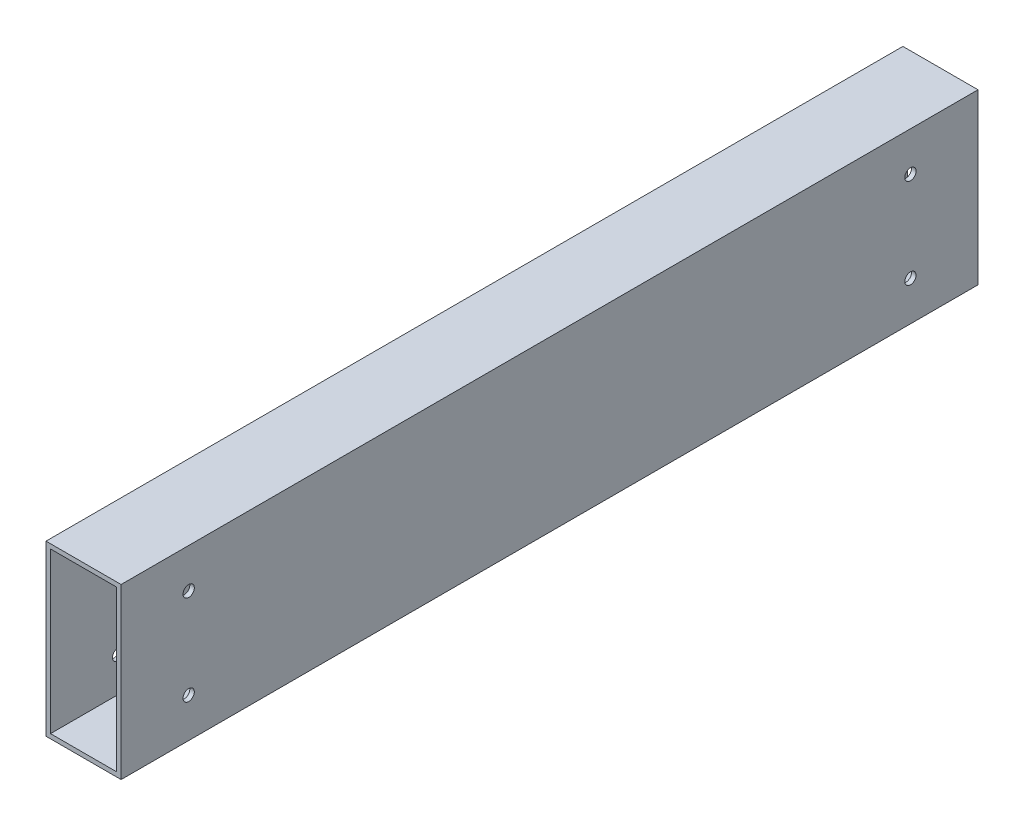
ISO-10303-21;
HEADER;
FILE_DESCRIPTION(('STEP AP214'),'2;1');
FILE_NAME('part.step','',(''),(''),'','','');
FILE_SCHEMA(('AUTOMOTIVE_DESIGN { 1 0 10303 214 1 1 1 1 }'));
ENDSEC;
DATA;
#1=APPLICATION_CONTEXT('core data for automotive mechanical design processes');
#2=APPLICATION_PROTOCOL_DEFINITION('international standard','automotive_design',2000,#1);
#3=PRODUCT_CONTEXT('',#1,'mechanical');
#4=PRODUCT('Part','Part','',(#3));
#5=PRODUCT_RELATED_PRODUCT_CATEGORY('part','',(#4));
#6=PRODUCT_DEFINITION_FORMATION('','',#4);
#7=PRODUCT_DEFINITION_CONTEXT('part definition',#1,'design');
#8=PRODUCT_DEFINITION('design','',#6,#7);
#9=PRODUCT_DEFINITION_SHAPE('','',#8);
#10=(LENGTH_UNIT() NAMED_UNIT(*) SI_UNIT(.MILLI.,.METRE.));
#11=(NAMED_UNIT(*) PLANE_ANGLE_UNIT() SI_UNIT($,.RADIAN.));
#12=(NAMED_UNIT(*) SI_UNIT($,.STERADIAN.) SOLID_ANGLE_UNIT());
#13=UNCERTAINTY_MEASURE_WITH_UNIT(LENGTH_MEASURE(1.E-05),#10,'distance_accuracy_value','');
#14=(GEOMETRIC_REPRESENTATION_CONTEXT(3) GLOBAL_UNCERTAINTY_ASSIGNED_CONTEXT((#13)) GLOBAL_UNIT_ASSIGNED_CONTEXT((#10,
#11,#12)) REPRESENTATION_CONTEXT('',''));
#15=CARTESIAN_POINT('',(0.,0.,0.));
#16=DIRECTION('',(0.,0.,1.));
#17=DIRECTION('',(1.,0.,0.));
#18=AXIS2_PLACEMENT_3D('',#15,#16,#17);
#19=CARTESIAN_POINT('',(10.0000000000001,-22.5,228.2));
#20=DIRECTION('',(-0.999999999999999,0.,0.));
#21=DIRECTION('',(0.,0.,0.999999999999999));
#22=AXIS2_PLACEMENT_3D('',#19,#20,#21);
#23=PLANE('',#22);
#24=CARTESIAN_POINT('',(10.0000000000001,-11.9999999999999,18.));
#25=DIRECTION('',(0.999999999999999,0.,0.));
#26=DIRECTION('',(0.,0.,-0.999999999999999));
#27=AXIS2_PLACEMENT_3D('',#24,#25,#26);
#28=CIRCLE('',#27,1.5);
#29=CARTESIAN_POINT('',(10.0000000000001,-11.9999999999999,16.5));
#30=VERTEX_POINT('',#29);
#31=EDGE_CURVE('E242',#30,#30,#28,.T.);
#32=ORIENTED_EDGE('',*,*,#31,.F.);
#33=EDGE_LOOP('',(#32));
#34=FACE_BOUND('',#33,.T.);
#35=CARTESIAN_POINT('',(10.0000000000001,12.0000000000001,17.9999999999999));
#36=DIRECTION('',(0.999999999999999,0.,0.));
#37=DIRECTION('',(0.,0.,-0.999999999999999));
#38=AXIS2_PLACEMENT_3D('',#35,#36,#37);
#39=CIRCLE('',#38,1.5);
#40=CARTESIAN_POINT('',(10.0000000000001,12.0000000000001,16.4999999999999));
#41=VERTEX_POINT('',#40);
#42=EDGE_CURVE('E246',#41,#41,#39,.T.);
#43=ORIENTED_EDGE('',*,*,#42,.F.);
#44=EDGE_LOOP('',(#43));
#45=FACE_BOUND('',#44,.T.);
#46=CARTESIAN_POINT('',(9.99999999999995,12.,210.2));
#47=DIRECTION('',(0.999999999999999,0.,0.));
#48=DIRECTION('',(0.,0.,-0.999999999999999));
#49=AXIS2_PLACEMENT_3D('',#46,#47,#48);
#50=CIRCLE('',#49,1.5);
#51=CARTESIAN_POINT('',(9.99999999999995,12.,208.7));
#52=VERTEX_POINT('',#51);
#53=EDGE_CURVE('E250',#52,#52,#50,.T.);
#54=ORIENTED_EDGE('',*,*,#53,.F.);
#55=EDGE_LOOP('',(#54));
#56=FACE_BOUND('',#55,.T.);
#57=CARTESIAN_POINT('',(10.0000000000001,-12.,210.2));
#58=DIRECTION('',(0.999999999999999,0.,0.));
#59=DIRECTION('',(0.,0.,-0.999999999999999));
#60=AXIS2_PLACEMENT_3D('',#57,#58,#59);
#61=CIRCLE('',#60,1.5);
#62=CARTESIAN_POINT('',(10.0000000000001,-12.,208.7));
#63=VERTEX_POINT('',#62);
#64=EDGE_CURVE('E165',#63,#63,#61,.T.);
#65=ORIENTED_EDGE('',*,*,#64,.F.);
#66=EDGE_LOOP('',(#65));
#67=FACE_BOUND('',#66,.T.);
#68=DIRECTION('',(0.,1.,0.));
#69=VECTOR('',#68,1.);
#70=CARTESIAN_POINT('',(10.0000000000002,-22.5,-1.11022302462516E-13));
#71=LINE('',#70,#69);
#72=CARTESIAN_POINT('',(10.0000000000002,-22.5,-1.11022302462516E-13));
#73=VERTEX_POINT('',#72);
#74=CARTESIAN_POINT('',(10.0000000000002,22.5,1.11022302462516E-13));
#75=VERTEX_POINT('',#74);
#76=EDGE_CURVE('E134',#73,#75,#71,.T.);
#77=ORIENTED_EDGE('',*,*,#76,.T.);
#78=DIRECTION('',(0.,0.,-0.999999999999999));
#79=VECTOR('',#78,1.);
#80=CARTESIAN_POINT('',(9.99999999999995,22.5,228.2));
#81=LINE('',#80,#79);
#82=CARTESIAN_POINT('',(9.99999999999995,22.5,228.2));
#83=VERTEX_POINT('',#82);
#84=EDGE_CURVE('E11',#83,#75,#81,.T.);
#85=ORIENTED_EDGE('',*,*,#84,.F.);
#86=DIRECTION('',(0.,1.,0.));
#87=VECTOR('',#86,1.);
#88=CARTESIAN_POINT('',(10.0000000000001,-22.5,228.2));
#89=LINE('',#88,#87);
#90=CARTESIAN_POINT('',(10.0000000000001,-22.5,228.2));
#91=VERTEX_POINT('',#90);
#92=EDGE_CURVE('E136',#91,#83,#89,.T.);
#93=ORIENTED_EDGE('',*,*,#92,.F.);
#94=DIRECTION('',(0.,0.,-0.999999999999999));
#95=VECTOR('',#94,1.);
#96=CARTESIAN_POINT('',(10.0000000000001,-22.5,228.2));
#97=LINE('',#96,#95);
#98=EDGE_CURVE('E146',#91,#73,#97,.T.);
#99=ORIENTED_EDGE('',*,*,#98,.T.);
#100=EDGE_LOOP('',(#77,#85,#93,#99));
#101=FACE_BOUND('',#100,.T.);
#102=ADVANCED_FACE('F38',(#34,#45,#56,#67,#101),#23,.F.);
#103=CARTESIAN_POINT('',(-10.0000000000001,22.5,228.2));
#104=DIRECTION('',(0.,-1.,0.));
#105=DIRECTION('',(0.,0.,-0.999999999999999));
#106=AXIS2_PLACEMENT_3D('',#103,#104,#105);
#107=PLANE('',#106);
#108=DIRECTION('',(-0.999999999999999,0.,0.));
#109=VECTOR('',#108,1.);
#110=CARTESIAN_POINT('',(-9.99999999999984,22.5,0.));
#111=LINE('',#110,#109);
#112=CARTESIAN_POINT('',(-9.99999999999984,22.5,0.));
#113=VERTEX_POINT('',#112);
#114=EDGE_CURVE('E149',#75,#113,#111,.T.);
#115=ORIENTED_EDGE('',*,*,#114,.T.);
#116=DIRECTION('',(0.,0.,-0.999999999999999));
#117=VECTOR('',#116,1.);
#118=CARTESIAN_POINT('',(-10.0000000000001,22.5,228.2));
#119=LINE('',#118,#117);
#120=CARTESIAN_POINT('',(-10.0000000000001,22.5,228.2));
#121=VERTEX_POINT('',#120);
#122=EDGE_CURVE('E46',#121,#113,#119,.T.);
#123=ORIENTED_EDGE('',*,*,#122,.F.);
#124=DIRECTION('',(-0.999999999999999,0.,0.));
#125=VECTOR('',#124,1.);
#126=CARTESIAN_POINT('',(-10.0000000000001,22.5,228.2));
#127=LINE('',#126,#125);
#128=EDGE_CURVE('E139',#83,#121,#127,.T.);
#129=ORIENTED_EDGE('',*,*,#128,.F.);
#130=ORIENTED_EDGE('',*,*,#84,.T.);
#131=EDGE_LOOP('',(#115,#123,#129,#130));
#132=FACE_BOUND('',#131,.T.);
#133=ADVANCED_FACE('F218',(#132),#107,.F.);
#134=CARTESIAN_POINT('',(-10.,-22.5,228.2));
#135=DIRECTION('',(0.999999999999999,0.,0.));
#136=DIRECTION('',(0.,0.,-0.999999999999999));
#137=AXIS2_PLACEMENT_3D('',#134,#135,#136);
#138=PLANE('',#137);
#139=CARTESIAN_POINT('',(-9.9999999999999,-11.9999999999999,17.9999999999999));
#140=DIRECTION('',(0.999999999999999,0.,0.));
#141=DIRECTION('',(0.,0.,-0.999999999999999));
#142=AXIS2_PLACEMENT_3D('',#139,#140,#141);
#143=CIRCLE('',#142,1.5);
#144=CARTESIAN_POINT('',(-9.9999999999999,-11.9999999999999,16.4999999999999));
#145=VERTEX_POINT('',#144);
#146=EDGE_CURVE('E192',#145,#145,#143,.T.);
#147=ORIENTED_EDGE('',*,*,#146,.T.);
#148=EDGE_LOOP('',(#147));
#149=FACE_BOUND('',#148,.T.);
#150=CARTESIAN_POINT('',(-9.99999999999995,12.,17.9999999999999));
#151=DIRECTION('',(0.999999999999999,0.,0.));
#152=DIRECTION('',(0.,0.,-0.999999999999999));
#153=AXIS2_PLACEMENT_3D('',#150,#151,#152);
#154=CIRCLE('',#153,1.5);
#155=CARTESIAN_POINT('',(-9.99999999999995,12.,16.4999999999999));
#156=VERTEX_POINT('',#155);
#157=EDGE_CURVE('E177',#156,#156,#154,.T.);
#158=ORIENTED_EDGE('',*,*,#157,.T.);
#159=EDGE_LOOP('',(#158));
#160=FACE_BOUND('',#159,.T.);
#161=CARTESIAN_POINT('',(-10.,12.,210.2));
#162=DIRECTION('',(0.999999999999999,0.,0.));
#163=DIRECTION('',(0.,0.,-0.999999999999999));
#164=AXIS2_PLACEMENT_3D('',#161,#162,#163);
#165=CIRCLE('',#164,1.5);
#166=CARTESIAN_POINT('',(-10.,12.,208.7));
#167=VERTEX_POINT('',#166);
#168=EDGE_CURVE('E173',#167,#167,#165,.T.);
#169=ORIENTED_EDGE('',*,*,#168,.T.);
#170=EDGE_LOOP('',(#169));
#171=FACE_BOUND('',#170,.T.);
#172=CARTESIAN_POINT('',(-10.,-12.,210.2));
#173=DIRECTION('',(0.999999999999999,0.,0.));
#174=DIRECTION('',(0.,0.,-0.999999999999999));
#175=AXIS2_PLACEMENT_3D('',#172,#173,#174);
#176=CIRCLE('',#175,1.5);
#177=CARTESIAN_POINT('',(-10.,-12.,208.7));
#178=VERTEX_POINT('',#177);
#179=EDGE_CURVE('E169',#178,#178,#176,.T.);
#180=ORIENTED_EDGE('',*,*,#179,.T.);
#181=EDGE_LOOP('',(#180));
#182=FACE_BOUND('',#181,.T.);
#183=DIRECTION('',(0.,-1.,0.));
#184=VECTOR('',#183,1.);
#185=CARTESIAN_POINT('',(-9.99999999999962,-22.5,1.11022302462516E-13));
#186=LINE('',#185,#184);
#187=CARTESIAN_POINT('',(-9.99999999999962,-22.5,1.11022302462516E-13));
#188=VERTEX_POINT('',#187);
#189=EDGE_CURVE('E151',#113,#188,#186,.T.);
#190=ORIENTED_EDGE('',*,*,#189,.T.);
#191=DIRECTION('',(0.,0.,-0.999999999999999));
#192=VECTOR('',#191,1.);
#193=CARTESIAN_POINT('',(-10.,-22.5,228.2));
#194=LINE('',#193,#192);
#195=CARTESIAN_POINT('',(-10.,-22.5,228.2));
#196=VERTEX_POINT('',#195);
#197=EDGE_CURVE('E156',#196,#188,#194,.T.);
#198=ORIENTED_EDGE('',*,*,#197,.F.);
#199=DIRECTION('',(0.,-1.,0.));
#200=VECTOR('',#199,1.);
#201=CARTESIAN_POINT('',(-10.,-22.5,228.2));
#202=LINE('',#201,#200);
#203=EDGE_CURVE('E142',#121,#196,#202,.T.);
#204=ORIENTED_EDGE('',*,*,#203,.F.);
#205=ORIENTED_EDGE('',*,*,#122,.T.);
#206=EDGE_LOOP('',(#190,#198,#204,#205));
#207=FACE_BOUND('',#206,.T.);
#208=ADVANCED_FACE('F223',(#149,#160,#171,#182,#207),#138,.F.);
#209=CARTESIAN_POINT('',(-10.,-22.5,228.2));
#210=DIRECTION('',(0.,1.,0.));
#211=DIRECTION('',(0.,0.,0.999999999999999));
#212=AXIS2_PLACEMENT_3D('',#209,#210,#211);
#213=PLANE('',#212);
#214=DIRECTION('',(0.999999999999999,0.,0.));
#215=VECTOR('',#214,1.);
#216=CARTESIAN_POINT('',(-9.99999999999962,-22.5,1.11022302462516E-13));
#217=LINE('',#216,#215);
#218=EDGE_CURVE('E140',#188,#73,#217,.T.);
#219=ORIENTED_EDGE('',*,*,#218,.T.);
#220=ORIENTED_EDGE('',*,*,#98,.F.);
#221=DIRECTION('',(0.999999999999999,0.,0.));
#222=VECTOR('',#221,1.);
#223=CARTESIAN_POINT('',(-10.,-22.5,228.2));
#224=LINE('',#223,#222);
#225=EDGE_CURVE('E144',#196,#91,#224,.T.);
#226=ORIENTED_EDGE('',*,*,#225,.F.);
#227=ORIENTED_EDGE('',*,*,#197,.T.);
#228=EDGE_LOOP('',(#219,#220,#226,#227));
#229=FACE_BOUND('',#228,.T.);
#230=ADVANCED_FACE('F208',(#229),#213,.F.);
#231=CARTESIAN_POINT('',(-1.11022302462516E-13,0.,228.2));
#232=DIRECTION('',(0.,0.,-0.999999999999999));
#233=DIRECTION('',(-0.999999999999999,0.,0.));
#234=AXIS2_PLACEMENT_3D('',#231,#232,#233);
#235=PLANE('',#234);
#236=DIRECTION('',(0.999999999999999,0.,0.));
#237=VECTOR('',#236,1.);
#238=CARTESIAN_POINT('',(8.79999999999992,-21.3000000000001,228.2));
#239=LINE('',#238,#237);
#240=CARTESIAN_POINT('',(-8.80000000000014,-21.3,228.2));
#241=VERTEX_POINT('',#240);
#242=CARTESIAN_POINT('',(8.79999999999992,-21.3000000000001,228.2));
#243=VERTEX_POINT('',#242);
#244=EDGE_CURVE('E196',#241,#243,#239,.T.);
#245=ORIENTED_EDGE('',*,*,#244,.F.);
#246=DIRECTION('',(0.,-1.,0.));
#247=VECTOR('',#246,1.);
#248=CARTESIAN_POINT('',(-8.80000000000009,21.3,228.2));
#249=LINE('',#248,#247);
#250=CARTESIAN_POINT('',(-8.80000000000009,21.3,228.2));
#251=VERTEX_POINT('',#250);
#252=EDGE_CURVE('E135',#251,#241,#249,.T.);
#253=ORIENTED_EDGE('',*,*,#252,.F.);
#254=DIRECTION('',(-0.999999999999999,0.,0.));
#255=VECTOR('',#254,1.);
#256=CARTESIAN_POINT('',(8.79999999999992,21.3,228.2));
#257=LINE('',#256,#255);
#258=CARTESIAN_POINT('',(8.79999999999992,21.3,228.2));
#259=VERTEX_POINT('',#258);
#260=EDGE_CURVE('E132',#259,#251,#257,.T.);
#261=ORIENTED_EDGE('',*,*,#260,.F.);
#262=DIRECTION('',(0.,1.,0.));
#263=VECTOR('',#262,1.);
#264=CARTESIAN_POINT('',(8.79999999999992,21.3,228.2));
#265=LINE('',#264,#263);
#266=EDGE_CURVE('E110',#243,#259,#265,.T.);
#267=ORIENTED_EDGE('',*,*,#266,.F.);
#268=EDGE_LOOP('',(#245,#253,#261,#267));
#269=FACE_BOUND('',#268,.T.);
#270=ORIENTED_EDGE('',*,*,#92,.T.);
#271=ORIENTED_EDGE('',*,*,#128,.T.);
#272=ORIENTED_EDGE('',*,*,#203,.T.);
#273=ORIENTED_EDGE('',*,*,#225,.T.);
#274=EDGE_LOOP('',(#270,#271,#272,#273));
#275=FACE_BOUND('',#274,.T.);
#276=ADVANCED_FACE('F205',(#269,#275),#235,.F.);
#277=CARTESIAN_POINT('',(0.,0.,0.));
#278=DIRECTION('',(0.,0.,-0.999999999999999));
#279=DIRECTION('',(-0.999999999999999,0.,0.));
#280=AXIS2_PLACEMENT_3D('',#277,#278,#279);
#281=PLANE('',#280);
#282=DIRECTION('',(0.,1.,0.));
#283=VECTOR('',#282,1.);
#284=CARTESIAN_POINT('',(-8.79999999999981,21.3,0.));
#285=LINE('',#284,#283);
#286=CARTESIAN_POINT('',(-8.79999999999992,-21.3,0.));
#287=VERTEX_POINT('',#286);
#288=CARTESIAN_POINT('',(-8.79999999999981,21.3,0.));
#289=VERTEX_POINT('',#288);
#290=EDGE_CURVE('E62',#287,#289,#285,.T.);
#291=ORIENTED_EDGE('',*,*,#290,.F.);
#292=DIRECTION('',(-0.999999999999999,0.,0.));
#293=VECTOR('',#292,1.);
#294=CARTESIAN_POINT('',(8.80000000000009,-21.3,0.));
#295=LINE('',#294,#293);
#296=CARTESIAN_POINT('',(8.80000000000009,-21.3,0.));
#297=VERTEX_POINT('',#296);
#298=EDGE_CURVE('E123',#297,#287,#295,.T.);
#299=ORIENTED_EDGE('',*,*,#298,.F.);
#300=DIRECTION('',(0.,-1.,0.));
#301=VECTOR('',#300,1.);
#302=CARTESIAN_POINT('',(8.8000000000002,21.3,-1.11022302462516E-13));
#303=LINE('',#302,#301);
#304=CARTESIAN_POINT('',(8.8000000000002,21.3,-1.11022302462516E-13));
#305=VERTEX_POINT('',#304);
#306=EDGE_CURVE('E107',#305,#297,#303,.T.);
#307=ORIENTED_EDGE('',*,*,#306,.F.);
#308=DIRECTION('',(0.999999999999999,0.,0.));
#309=VECTOR('',#308,1.);
#310=CARTESIAN_POINT('',(8.8000000000002,21.3,-1.11022302462516E-13));
#311=LINE('',#310,#309);
#312=EDGE_CURVE('E116',#289,#305,#311,.T.);
#313=ORIENTED_EDGE('',*,*,#312,.F.);
#314=EDGE_LOOP('',(#291,#299,#307,#313));
#315=FACE_BOUND('',#314,.T.);
#316=ORIENTED_EDGE('',*,*,#76,.F.);
#317=ORIENTED_EDGE('',*,*,#218,.F.);
#318=ORIENTED_EDGE('',*,*,#189,.F.);
#319=ORIENTED_EDGE('',*,*,#114,.F.);
#320=EDGE_LOOP('',(#316,#317,#318,#319));
#321=FACE_BOUND('',#320,.T.);
#322=ADVANCED_FACE('F120',(#315,#321),#281,.T.);
#323=CARTESIAN_POINT('',(-8.79999999999981,21.3,274.292515661439));
#324=DIRECTION('',(-0.999999999999999,0.,0.));
#325=DIRECTION('',(0.,0.,0.999999999999999));
#326=AXIS2_PLACEMENT_3D('',#323,#324,#325);
#327=PLANE('',#326);
#328=CARTESIAN_POINT('',(-8.79999999999997,-11.9999999999999,18.));
#329=DIRECTION('',(-0.999999999999999,0.,0.));
#330=DIRECTION('',(0.,0.,0.999999999999999));
#331=AXIS2_PLACEMENT_3D('',#328,#329,#330);
#332=CIRCLE('',#331,1.5);
#333=CARTESIAN_POINT('',(-8.79999999999997,-11.9999999999999,19.5));
#334=VERTEX_POINT('',#333);
#335=EDGE_CURVE('E189',#334,#334,#332,.T.);
#336=ORIENTED_EDGE('',*,*,#335,.T.);
#337=EDGE_LOOP('',(#336));
#338=FACE_BOUND('',#337,.T.);
#339=CARTESIAN_POINT('',(-8.79999999999992,12.0000000000001,18.));
#340=DIRECTION('',(-0.999999999999999,0.,0.));
#341=DIRECTION('',(0.,0.,0.999999999999999));
#342=AXIS2_PLACEMENT_3D('',#339,#340,#341);
#343=CIRCLE('',#342,1.5);
#344=CARTESIAN_POINT('',(-8.79999999999992,12.0000000000001,19.5));
#345=VERTEX_POINT('',#344);
#346=EDGE_CURVE('E172',#345,#345,#343,.T.);
#347=ORIENTED_EDGE('',*,*,#346,.T.);
#348=EDGE_LOOP('',(#347));
#349=FACE_BOUND('',#348,.T.);
#350=CARTESIAN_POINT('',(-8.80000000000009,12.,210.2));
#351=DIRECTION('',(-0.999999999999999,0.,0.));
#352=DIRECTION('',(0.,0.,0.999999999999999));
#353=AXIS2_PLACEMENT_3D('',#350,#351,#352);
#354=CIRCLE('',#353,1.5);
#355=CARTESIAN_POINT('',(-8.80000000000009,12.,211.7));
#356=VERTEX_POINT('',#355);
#357=EDGE_CURVE('E168',#356,#356,#354,.T.);
#358=ORIENTED_EDGE('',*,*,#357,.T.);
#359=EDGE_LOOP('',(#358));
#360=FACE_BOUND('',#359,.T.);
#361=CARTESIAN_POINT('',(-8.79999999999992,-11.9999999999999,210.2));
#362=DIRECTION('',(-0.999999999999999,0.,0.));
#363=DIRECTION('',(0.,0.,0.999999999999999));
#364=AXIS2_PLACEMENT_3D('',#361,#362,#363);
#365=CIRCLE('',#364,1.5);
#366=CARTESIAN_POINT('',(-8.79999999999992,-11.9999999999999,211.7));
#367=VERTEX_POINT('',#366);
#368=EDGE_CURVE('E164',#367,#367,#365,.T.);
#369=ORIENTED_EDGE('',*,*,#368,.T.);
#370=EDGE_LOOP('',(#369));
#371=FACE_BOUND('',#370,.T.);
#372=ORIENTED_EDGE('',*,*,#252,.T.);
#373=DIRECTION('',(0.,0.,-0.999999999999999));
#374=VECTOR('',#373,1.);
#375=CARTESIAN_POINT('',(-8.79999999999992,-21.3,274.292515661439));
#376=LINE('',#375,#374);
#377=EDGE_CURVE('E128',#241,#287,#376,.T.);
#378=ORIENTED_EDGE('',*,*,#377,.T.);
#379=ORIENTED_EDGE('',*,*,#290,.T.);
#380=DIRECTION('',(0.,0.,-0.999999999999999));
#381=VECTOR('',#380,1.);
#382=CARTESIAN_POINT('',(-8.79999999999981,21.3,274.292515661439));
#383=LINE('',#382,#381);
#384=EDGE_CURVE('E113',#251,#289,#383,.T.);
#385=ORIENTED_EDGE('',*,*,#384,.F.);
#386=EDGE_LOOP('',(#372,#378,#379,#385));
#387=FACE_BOUND('',#386,.T.);
#388=ADVANCED_FACE('F200',(#338,#349,#360,#371,#387),#327,.F.);
#389=CARTESIAN_POINT('',(8.80000000000014,-21.3000000000001,274.292515661439));
#390=DIRECTION('',(0.,-1.,0.));
#391=DIRECTION('',(0.,0.,-0.999999999999999));
#392=AXIS2_PLACEMENT_3D('',#389,#390,#391);
#393=PLANE('',#392);
#394=ORIENTED_EDGE('',*,*,#244,.T.);
#395=DIRECTION('',(0.,0.,-0.999999999999999));
#396=VECTOR('',#395,1.);
#397=CARTESIAN_POINT('',(8.80000000000014,-21.3000000000001,274.292515661439));
#398=LINE('',#397,#396);
#399=EDGE_CURVE('E112',#243,#297,#398,.T.);
#400=ORIENTED_EDGE('',*,*,#399,.T.);
#401=ORIENTED_EDGE('',*,*,#298,.T.);
#402=ORIENTED_EDGE('',*,*,#377,.F.);
#403=EDGE_LOOP('',(#394,#400,#401,#402));
#404=FACE_BOUND('',#403,.T.);
#405=ADVANCED_FACE('F204',(#404),#393,.F.);
#406=CARTESIAN_POINT('',(8.80000000000009,21.3,274.292515661439));
#407=DIRECTION('',(0.999999999999999,0.,0.));
#408=DIRECTION('',(0.,0.,-0.999999999999999));
#409=AXIS2_PLACEMENT_3D('',#406,#407,#408);
#410=PLANE('',#409);
#411=CARTESIAN_POINT('',(8.79999999999997,-12.,18.));
#412=DIRECTION('',(0.999999999999999,0.,0.));
#413=DIRECTION('',(0.,0.,-0.999999999999999));
#414=AXIS2_PLACEMENT_3D('',#411,#412,#413);
#415=CIRCLE('',#414,1.5);
#416=CARTESIAN_POINT('',(8.79999999999997,-12.,16.5));
#417=VERTEX_POINT('',#416);
#418=EDGE_CURVE('E41',#417,#417,#415,.T.);
#419=ORIENTED_EDGE('',*,*,#418,.T.);
#420=EDGE_LOOP('',(#419));
#421=FACE_BOUND('',#420,.T.);
#422=CARTESIAN_POINT('',(8.79999999999997,12.,18.));
#423=DIRECTION('',(0.999999999999999,0.,0.));
#424=DIRECTION('',(0.,0.,-0.999999999999999));
#425=AXIS2_PLACEMENT_3D('',#422,#423,#424);
#426=CIRCLE('',#425,1.5);
#427=CARTESIAN_POINT('',(8.79999999999997,12.,16.5));
#428=VERTEX_POINT('',#427);
#429=EDGE_CURVE('E170',#428,#428,#426,.T.);
#430=ORIENTED_EDGE('',*,*,#429,.T.);
#431=EDGE_LOOP('',(#430));
#432=FACE_BOUND('',#431,.T.);
#433=CARTESIAN_POINT('',(8.80000000000003,12.,210.2));
#434=DIRECTION('',(0.999999999999999,0.,0.));
#435=DIRECTION('',(0.,0.,-0.999999999999999));
#436=AXIS2_PLACEMENT_3D('',#433,#434,#435);
#437=CIRCLE('',#436,1.5);
#438=CARTESIAN_POINT('',(8.80000000000003,12.,208.7));
#439=VERTEX_POINT('',#438);
#440=EDGE_CURVE('E166',#439,#439,#437,.T.);
#441=ORIENTED_EDGE('',*,*,#440,.T.);
#442=EDGE_LOOP('',(#441));
#443=FACE_BOUND('',#442,.T.);
#444=CARTESIAN_POINT('',(8.80000000000009,-11.9999999999999,210.2));
#445=DIRECTION('',(0.999999999999999,0.,0.));
#446=DIRECTION('',(0.,0.,-0.999999999999999));
#447=AXIS2_PLACEMENT_3D('',#444,#445,#446);
#448=CIRCLE('',#447,1.5);
#449=CARTESIAN_POINT('',(8.80000000000009,-11.9999999999999,208.7));
#450=VERTEX_POINT('',#449);
#451=EDGE_CURVE('E161',#450,#450,#448,.T.);
#452=ORIENTED_EDGE('',*,*,#451,.T.);
#453=EDGE_LOOP('',(#452));
#454=FACE_BOUND('',#453,.T.);
#455=ORIENTED_EDGE('',*,*,#266,.T.);
#456=DIRECTION('',(0.,0.,-0.999999999999999));
#457=VECTOR('',#456,1.);
#458=CARTESIAN_POINT('',(8.80000000000009,21.3,274.292515661439));
#459=LINE('',#458,#457);
#460=EDGE_CURVE('E54',#259,#305,#459,.T.);
#461=ORIENTED_EDGE('',*,*,#460,.T.);
#462=ORIENTED_EDGE('',*,*,#306,.T.);
#463=ORIENTED_EDGE('',*,*,#399,.F.);
#464=EDGE_LOOP('',(#455,#461,#462,#463));
#465=FACE_BOUND('',#464,.T.);
#466=ADVANCED_FACE('F104',(#421,#432,#443,#454,#465),#410,.F.);
#467=CARTESIAN_POINT('',(8.80000000000009,21.3,274.292515661439));
#468=DIRECTION('',(0.,1.,0.));
#469=DIRECTION('',(0.,0.,0.999999999999999));
#470=AXIS2_PLACEMENT_3D('',#467,#468,#469);
#471=PLANE('',#470);
#472=ORIENTED_EDGE('',*,*,#260,.T.);
#473=ORIENTED_EDGE('',*,*,#384,.T.);
#474=ORIENTED_EDGE('',*,*,#312,.T.);
#475=ORIENTED_EDGE('',*,*,#460,.F.);
#476=EDGE_LOOP('',(#472,#473,#474,#475));
#477=FACE_BOUND('',#476,.T.);
#478=ADVANCED_FACE('F117',(#477),#471,.F.);
#479=CARTESIAN_POINT('',(-20.,-11.9999999999999,210.2));
#480=DIRECTION('',(0.999999999999999,0.,0.));
#481=DIRECTION('',(0.,0.,-0.999999999999999));
#482=AXIS2_PLACEMENT_3D('',#479,#480,#481);
#483=CYLINDRICAL_SURFACE('',#482,1.5);
#484=ORIENTED_EDGE('',*,*,#64,.T.);
#485=EDGE_LOOP('',(#484));
#486=FACE_BOUND('',#485,.T.);
#487=ORIENTED_EDGE('',*,*,#451,.F.);
#488=EDGE_LOOP('',(#487));
#489=FACE_BOUND('',#488,.T.);
#490=ADVANCED_FACE('F270',(#486,#489),#483,.F.);
#491=CARTESIAN_POINT('',(-20.,12.,210.2));
#492=DIRECTION('',(0.999999999999999,0.,0.));
#493=DIRECTION('',(0.,0.,-0.999999999999999));
#494=AXIS2_PLACEMENT_3D('',#491,#492,#493);
#495=CYLINDRICAL_SURFACE('',#494,1.5);
#496=ORIENTED_EDGE('',*,*,#53,.T.);
#497=EDGE_LOOP('',(#496));
#498=FACE_BOUND('',#497,.T.);
#499=ORIENTED_EDGE('',*,*,#440,.F.);
#500=EDGE_LOOP('',(#499));
#501=FACE_BOUND('',#500,.T.);
#502=ADVANCED_FACE('F278',(#498,#501),#495,.F.);
#503=CARTESIAN_POINT('',(-20.,12.,17.9999999999999));
#504=DIRECTION('',(0.999999999999999,0.,0.));
#505=DIRECTION('',(0.,0.,-0.999999999999999));
#506=AXIS2_PLACEMENT_3D('',#503,#504,#505);
#507=CYLINDRICAL_SURFACE('',#506,1.5);
#508=ORIENTED_EDGE('',*,*,#42,.T.);
#509=EDGE_LOOP('',(#508));
#510=FACE_BOUND('',#509,.T.);
#511=ORIENTED_EDGE('',*,*,#429,.F.);
#512=EDGE_LOOP('',(#511));
#513=FACE_BOUND('',#512,.T.);
#514=ADVANCED_FACE('F279',(#510,#513),#507,.F.);
#515=CARTESIAN_POINT('',(-19.9999999999999,-12.,18.));
#516=DIRECTION('',(0.999999999999999,0.,0.));
#517=DIRECTION('',(0.,0.,-0.999999999999999));
#518=AXIS2_PLACEMENT_3D('',#515,#516,#517);
#519=CYLINDRICAL_SURFACE('',#518,1.5);
#520=ORIENTED_EDGE('',*,*,#31,.T.);
#521=EDGE_LOOP('',(#520));
#522=FACE_BOUND('',#521,.T.);
#523=ORIENTED_EDGE('',*,*,#418,.F.);
#524=EDGE_LOOP('',(#523));
#525=FACE_BOUND('',#524,.T.);
#526=ADVANCED_FACE('F267',(#522,#525),#519,.F.);
#527=ORIENTED_EDGE('',*,*,#368,.F.);
#528=EDGE_LOOP('',(#527));
#529=FACE_BOUND('',#528,.T.);
#530=ORIENTED_EDGE('',*,*,#179,.F.);
#531=EDGE_LOOP('',(#530));
#532=FACE_BOUND('',#531,.T.);
#533=ADVANCED_FACE('F264',(#529,#532),#483,.F.);
#534=ORIENTED_EDGE('',*,*,#357,.F.);
#535=EDGE_LOOP('',(#534));
#536=FACE_BOUND('',#535,.T.);
#537=ORIENTED_EDGE('',*,*,#168,.F.);
#538=EDGE_LOOP('',(#537));
#539=FACE_BOUND('',#538,.T.);
#540=ADVANCED_FACE('F266',(#536,#539),#495,.F.);
#541=ORIENTED_EDGE('',*,*,#346,.F.);
#542=EDGE_LOOP('',(#541));
#543=FACE_BOUND('',#542,.T.);
#544=ORIENTED_EDGE('',*,*,#157,.F.);
#545=EDGE_LOOP('',(#544));
#546=FACE_BOUND('',#545,.T.);
#547=ADVANCED_FACE('F275',(#543,#546),#507,.F.);
#548=ORIENTED_EDGE('',*,*,#335,.F.);
#549=EDGE_LOOP('',(#548));
#550=FACE_BOUND('',#549,.T.);
#551=ORIENTED_EDGE('',*,*,#146,.F.);
#552=EDGE_LOOP('',(#551));
#553=FACE_BOUND('',#552,.T.);
#554=ADVANCED_FACE('F282',(#550,#553),#519,.F.);
#555=CLOSED_SHELL('',(#102,#133,#208,#230,#276,#322,#388,#405,#466,#478,#490,#502,#514,#526,
#533,#540,#547,#554));
#556=MANIFOLD_SOLID_BREP('B2',#555);
#557=ADVANCED_BREP_SHAPE_REPRESENTATION('',(#18,#556),#14);
#558=SHAPE_DEFINITION_REPRESENTATION(#9,#557);
ENDSEC;
END-ISO-10303-21;
